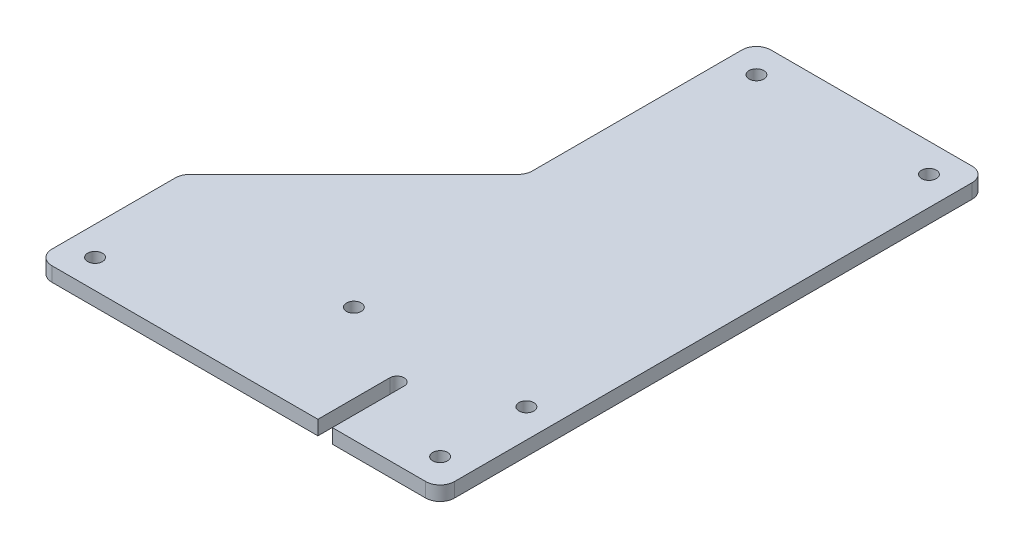
ISO-10303-21;
HEADER;
FILE_DESCRIPTION(('STEP AP214'),'2;1');
FILE_NAME('part.step','',(''),(''),'','','');
FILE_SCHEMA(('AUTOMOTIVE_DESIGN { 1 0 10303 214 1 1 1 1 }'));
ENDSEC;
DATA;
#1=APPLICATION_CONTEXT('core data for automotive mechanical design processes');
#2=APPLICATION_PROTOCOL_DEFINITION('international standard','automotive_design',2000,#1);
#3=PRODUCT_CONTEXT('',#1,'mechanical');
#4=PRODUCT('Part','Part','',(#3));
#5=PRODUCT_RELATED_PRODUCT_CATEGORY('part','',(#4));
#6=PRODUCT_DEFINITION_FORMATION('','',#4);
#7=PRODUCT_DEFINITION_CONTEXT('part definition',#1,'design');
#8=PRODUCT_DEFINITION('design','',#6,#7);
#9=PRODUCT_DEFINITION_SHAPE('','',#8);
#10=(LENGTH_UNIT() NAMED_UNIT(*) SI_UNIT(.MILLI.,.METRE.));
#11=(NAMED_UNIT(*) PLANE_ANGLE_UNIT() SI_UNIT($,.RADIAN.));
#12=(NAMED_UNIT(*) SI_UNIT($,.STERADIAN.) SOLID_ANGLE_UNIT());
#13=UNCERTAINTY_MEASURE_WITH_UNIT(LENGTH_MEASURE(1.E-05),#10,'distance_accuracy_value','');
#14=(GEOMETRIC_REPRESENTATION_CONTEXT(3) GLOBAL_UNCERTAINTY_ASSIGNED_CONTEXT((#13)) GLOBAL_UNIT_ASSIGNED_CONTEXT((#10,
#11,#12)) REPRESENTATION_CONTEXT('',''));
#15=CARTESIAN_POINT('',(0.,0.,0.));
#16=DIRECTION('',(0.,0.,1.));
#17=DIRECTION('',(1.,0.,0.));
#18=AXIS2_PLACEMENT_3D('',#15,#16,#17);
#19=CARTESIAN_POINT('',(88.9,6.35,12.7));
#20=DIRECTION('',(0.,0.,-1.));
#21=DIRECTION('',(-1.,0.,0.));
#22=AXIS2_PLACEMENT_3D('',#19,#20,#21);
#23=PLANE('',#22);
#24=DIRECTION('',(1.,0.,0.));
#25=VECTOR('',#24,1.);
#26=CARTESIAN_POINT('',(88.9,6.35,12.7));
#27=LINE('',#26,#25);
#28=CARTESIAN_POINT('',(41.275,6.35,12.7));
#29=VERTEX_POINT('',#28);
#30=CARTESIAN_POINT('',(82.55,6.35,12.7));
#31=VERTEX_POINT('',#30);
#32=EDGE_CURVE('E172',#29,#31,#27,.T.);
#33=ORIENTED_EDGE('',*,*,#32,.F.);
#34=DIRECTION('',(0.,1.,0.));
#35=VECTOR('',#34,1.);
#36=CARTESIAN_POINT('',(41.275,-0.00100000000000013,12.7));
#37=LINE('',#36,#35);
#38=CARTESIAN_POINT('',(41.275,0.,12.7));
#39=VERTEX_POINT('',#38);
#40=EDGE_CURVE('E165',#39,#29,#37,.T.);
#41=ORIENTED_EDGE('',*,*,#40,.F.);
#42=DIRECTION('',(1.,0.,0.));
#43=VECTOR('',#42,1.);
#44=CARTESIAN_POINT('',(88.9,0.,12.7));
#45=LINE('',#44,#43);
#46=CARTESIAN_POINT('',(82.55,0.,12.7));
#47=VERTEX_POINT('',#46);
#48=EDGE_CURVE('E193',#39,#47,#45,.T.);
#49=ORIENTED_EDGE('',*,*,#48,.T.);
#50=DIRECTION('',(0.,-1.,0.));
#51=VECTOR('',#50,1.);
#52=CARTESIAN_POINT('',(82.55,6.35,12.7));
#53=LINE('',#52,#51);
#54=EDGE_CURVE('E236',#47,#31,#53,.F.);
#55=ORIENTED_EDGE('',*,*,#54,.T.);
#56=EDGE_LOOP('',(#33,#41,#49,#55));
#57=FACE_BOUND('',#56,.T.);
#58=ADVANCED_FACE('F33',(#57),#23,.F.);
#59=CARTESIAN_POINT('',(-12.7,6.35,-127.));
#60=DIRECTION('',(1.,0.,0.));
#61=DIRECTION('',(0.,0.,-1.));
#62=AXIS2_PLACEMENT_3D('',#59,#60,#61);
#63=PLANE('',#62);
#64=DIRECTION('',(0.,0.,1.));
#65=VECTOR('',#64,1.);
#66=CARTESIAN_POINT('',(-12.7,6.35,-127.));
#67=LINE('',#66,#65);
#68=CARTESIAN_POINT('',(-12.7,6.35,-222.25));
#69=VERTEX_POINT('',#68);
#70=CARTESIAN_POINT('',(-12.7,6.35,-129.630256121069));
#71=VERTEX_POINT('',#70);
#72=EDGE_CURVE('E200',#69,#71,#67,.T.);
#73=ORIENTED_EDGE('',*,*,#72,.F.);
#74=DIRECTION('',(0.,-1.,0.));
#75=VECTOR('',#74,1.);
#76=CARTESIAN_POINT('',(-12.7,6.35,-222.25));
#77=LINE('',#76,#75);
#78=CARTESIAN_POINT('',(-12.7,0.,-222.25));
#79=VERTEX_POINT('',#78);
#80=EDGE_CURVE('E202',#69,#79,#77,.T.);
#81=ORIENTED_EDGE('',*,*,#80,.T.);
#82=DIRECTION('',(0.,0.,1.));
#83=VECTOR('',#82,1.);
#84=CARTESIAN_POINT('',(-12.7,0.,-127.));
#85=LINE('',#84,#83);
#86=CARTESIAN_POINT('',(-12.7,0.,-129.630256121069));
#87=VERTEX_POINT('',#86);
#88=EDGE_CURVE('E183',#79,#87,#85,.T.);
#89=ORIENTED_EDGE('',*,*,#88,.T.);
#90=DIRECTION('',(0.,-1.,0.));
#91=VECTOR('',#90,1.);
#92=CARTESIAN_POINT('',(-12.7,6.35,-129.630256121069));
#93=LINE('',#92,#91);
#94=EDGE_CURVE('E182',#87,#71,#93,.F.);
#95=ORIENTED_EDGE('',*,*,#94,.T.);
#96=EDGE_LOOP('',(#73,#81,#89,#95));
#97=FACE_BOUND('',#96,.T.);
#98=ADVANCED_FACE('F259',(#97),#63,.F.);
#99=CARTESIAN_POINT('',(-88.9,6.35,-50.8));
#100=DIRECTION('',(0.707106781186549,0.,0.707106781186546));
#101=DIRECTION('',(0.707106781186546,0.,-0.707106781186549));
#102=AXIS2_PLACEMENT_3D('',#99,#100,#101);
#103=PLANE('',#102);
#104=DIRECTION('',(-0.707106781186546,0.,0.707106781186549));
#105=VECTOR('',#104,1.);
#106=CARTESIAN_POINT('',(-88.9,0.,-50.8));
#107=LINE('',#106,#105);
#108=CARTESIAN_POINT('',(-14.5598719394654,0.,-125.140128060535));
#109=VERTEX_POINT('',#108);
#110=CARTESIAN_POINT('',(-87.0401280605346,0.,-52.6598719394654));
#111=VERTEX_POINT('',#110);
#112=EDGE_CURVE('E186',#109,#111,#107,.T.);
#113=ORIENTED_EDGE('',*,*,#112,.T.);
#114=DIRECTION('',(0.,-1.,0.));
#115=VECTOR('',#114,1.);
#116=CARTESIAN_POINT('',(-87.0401280605346,6.35,-52.6598719394654));
#117=LINE('',#116,#115);
#118=CARTESIAN_POINT('',(-87.0401280605346,6.35,-52.6598719394654));
#119=VERTEX_POINT('',#118);
#120=EDGE_CURVE('E247',#111,#119,#117,.F.);
#121=ORIENTED_EDGE('',*,*,#120,.T.);
#122=DIRECTION('',(-0.707106781186546,0.,0.707106781186549));
#123=VECTOR('',#122,1.);
#124=CARTESIAN_POINT('',(-88.9,6.35,-50.8));
#125=LINE('',#124,#123);
#126=CARTESIAN_POINT('',(-14.5598719394654,6.35,-125.140128060535));
#127=VERTEX_POINT('',#126);
#128=EDGE_CURVE('E265',#127,#119,#125,.T.);
#129=ORIENTED_EDGE('',*,*,#128,.F.);
#130=DIRECTION('',(0.,-1.,0.));
#131=VECTOR('',#130,1.);
#132=CARTESIAN_POINT('',(-14.5598719394654,0.,-125.140128060535));
#133=LINE('',#132,#131);
#134=EDGE_CURVE('E244',#127,#109,#133,.T.);
#135=ORIENTED_EDGE('',*,*,#134,.T.);
#136=EDGE_LOOP('',(#113,#121,#129,#135));
#137=FACE_BOUND('',#136,.T.);
#138=ADVANCED_FACE('F268',(#137),#103,.F.);
#139=CARTESIAN_POINT('',(-88.9,6.35,12.7));
#140=DIRECTION('',(1.,0.,0.));
#141=DIRECTION('',(0.,0.,-1.));
#142=AXIS2_PLACEMENT_3D('',#139,#140,#141);
#143=PLANE('',#142);
#144=DIRECTION('',(0.,0.,1.));
#145=VECTOR('',#144,1.);
#146=CARTESIAN_POINT('',(-88.9,0.,12.7));
#147=LINE('',#146,#145);
#148=CARTESIAN_POINT('',(-88.9,0.,-48.1697438789308));
#149=VERTEX_POINT('',#148);
#150=CARTESIAN_POINT('',(-88.9,0.,6.35000000000002));
#151=VERTEX_POINT('',#150);
#152=EDGE_CURVE('E190',#149,#151,#147,.T.);
#153=ORIENTED_EDGE('',*,*,#152,.T.);
#154=DIRECTION('',(0.,-1.,0.));
#155=VECTOR('',#154,1.);
#156=CARTESIAN_POINT('',(-88.9,6.35,6.35000000000002));
#157=LINE('',#156,#155);
#158=CARTESIAN_POINT('',(-88.9,6.35,6.35000000000002));
#159=VERTEX_POINT('',#158);
#160=EDGE_CURVE('E242',#151,#159,#157,.F.);
#161=ORIENTED_EDGE('',*,*,#160,.T.);
#162=DIRECTION('',(0.,0.,1.));
#163=VECTOR('',#162,1.);
#164=CARTESIAN_POINT('',(-88.9,6.35,12.7));
#165=LINE('',#164,#163);
#166=CARTESIAN_POINT('',(-88.9,6.35,-48.1697438789308));
#167=VERTEX_POINT('',#166);
#168=EDGE_CURVE('E176',#167,#159,#165,.T.);
#169=ORIENTED_EDGE('',*,*,#168,.F.);
#170=DIRECTION('',(0.,-1.,0.));
#171=VECTOR('',#170,1.);
#172=CARTESIAN_POINT('',(-88.9,6.35,-48.1697438789308));
#173=LINE('',#172,#171);
#174=EDGE_CURVE('E239',#167,#149,#173,.T.);
#175=ORIENTED_EDGE('',*,*,#174,.T.);
#176=EDGE_LOOP('',(#153,#161,#169,#175));
#177=FACE_BOUND('',#176,.T.);
#178=ADVANCED_FACE('F367',(#177),#143,.F.);
#179=CARTESIAN_POINT('',(-82.55,0.,12.7));
#180=VERTEX_POINT('',#179);
#181=CARTESIAN_POINT('',(34.925,0.,12.7));
#182=VERTEX_POINT('',#181);
#183=EDGE_CURVE('E164',#180,#182,#45,.T.);
#184=ORIENTED_EDGE('',*,*,#183,.T.);
#185=DIRECTION('',(0.,-1.,0.));
#186=VECTOR('',#185,1.);
#187=CARTESIAN_POINT('',(34.925,-0.00100000000000013,12.7));
#188=LINE('',#187,#186);
#189=CARTESIAN_POINT('',(34.925,6.35,12.7));
#190=VERTEX_POINT('',#189);
#191=EDGE_CURVE('E48',#190,#182,#188,.T.);
#192=ORIENTED_EDGE('',*,*,#191,.F.);
#193=CARTESIAN_POINT('',(-82.55,6.35,12.7));
#194=VERTEX_POINT('',#193);
#195=EDGE_CURVE('E161',#194,#190,#27,.T.);
#196=ORIENTED_EDGE('',*,*,#195,.F.);
#197=DIRECTION('',(0.,-1.,0.));
#198=VECTOR('',#197,1.);
#199=CARTESIAN_POINT('',(-82.55,6.35,12.7));
#200=LINE('',#199,#198);
#201=EDGE_CURVE('E234',#194,#180,#200,.T.);
#202=ORIENTED_EDGE('',*,*,#201,.T.);
#203=EDGE_LOOP('',(#184,#192,#196,#202));
#204=FACE_BOUND('',#203,.T.);
#205=ADVANCED_FACE('F159',(#204),#23,.F.);
#206=CARTESIAN_POINT('',(88.9,6.35,-228.6));
#207=DIRECTION('',(-1.,0.,0.));
#208=DIRECTION('',(0.,0.,1.));
#209=AXIS2_PLACEMENT_3D('',#206,#207,#208);
#210=PLANE('',#209);
#211=DIRECTION('',(0.,0.,-1.));
#212=VECTOR('',#211,1.);
#213=CARTESIAN_POINT('',(88.9,0.,-228.6));
#214=LINE('',#213,#212);
#215=CARTESIAN_POINT('',(88.9,0.,6.34999999999999));
#216=VERTEX_POINT('',#215);
#217=CARTESIAN_POINT('',(88.9,0.,-222.25));
#218=VERTEX_POINT('',#217);
#219=EDGE_CURVE('E195',#216,#218,#214,.T.);
#220=ORIENTED_EDGE('',*,*,#219,.T.);
#221=DIRECTION('',(0.,-1.,0.));
#222=VECTOR('',#221,1.);
#223=CARTESIAN_POINT('',(88.9,6.35,-222.25));
#224=LINE('',#223,#222);
#225=CARTESIAN_POINT('',(88.9,6.35,-222.25));
#226=VERTEX_POINT('',#225);
#227=EDGE_CURVE('E56',#218,#226,#224,.F.);
#228=ORIENTED_EDGE('',*,*,#227,.T.);
#229=DIRECTION('',(0.,0.,-1.));
#230=VECTOR('',#229,1.);
#231=CARTESIAN_POINT('',(88.9,6.35,-228.6));
#232=LINE('',#231,#230);
#233=CARTESIAN_POINT('',(88.9,6.35,6.34999999999999));
#234=VERTEX_POINT('',#233);
#235=EDGE_CURVE('E171',#234,#226,#232,.T.);
#236=ORIENTED_EDGE('',*,*,#235,.F.);
#237=DIRECTION('',(0.,-1.,0.));
#238=VECTOR('',#237,1.);
#239=CARTESIAN_POINT('',(88.9,6.35,6.34999999999999));
#240=LINE('',#239,#238);
#241=EDGE_CURVE('E230',#234,#216,#240,.T.);
#242=ORIENTED_EDGE('',*,*,#241,.T.);
#243=EDGE_LOOP('',(#220,#228,#236,#242));
#244=FACE_BOUND('',#243,.T.);
#245=ADVANCED_FACE('F333',(#244),#210,.F.);
#246=CARTESIAN_POINT('',(-12.7,6.35,-228.6));
#247=DIRECTION('',(0.,0.,1.));
#248=DIRECTION('',(1.,0.,0.));
#249=AXIS2_PLACEMENT_3D('',#246,#247,#248);
#250=PLANE('',#249);
#251=DIRECTION('',(-1.,0.,0.));
#252=VECTOR('',#251,1.);
#253=CARTESIAN_POINT('',(-12.7,0.,-228.6));
#254=LINE('',#253,#252);
#255=CARTESIAN_POINT('',(82.55,0.,-228.6));
#256=VERTEX_POINT('',#255);
#257=CARTESIAN_POINT('',(-6.35,0.,-228.6));
#258=VERTEX_POINT('',#257);
#259=EDGE_CURVE('E197',#256,#258,#254,.T.);
#260=ORIENTED_EDGE('',*,*,#259,.T.);
#261=DIRECTION('',(0.,-1.,0.));
#262=VECTOR('',#261,1.);
#263=CARTESIAN_POINT('',(-6.35,6.35,-228.6));
#264=LINE('',#263,#262);
#265=CARTESIAN_POINT('',(-6.35,6.35,-228.6));
#266=VERTEX_POINT('',#265);
#267=EDGE_CURVE('E219',#258,#266,#264,.F.);
#268=ORIENTED_EDGE('',*,*,#267,.T.);
#269=DIRECTION('',(-1.,0.,0.));
#270=VECTOR('',#269,1.);
#271=CARTESIAN_POINT('',(-12.7,6.35,-228.6));
#272=LINE('',#271,#270);
#273=CARTESIAN_POINT('',(82.55,6.35,-228.6));
#274=VERTEX_POINT('',#273);
#275=EDGE_CURVE('E174',#274,#266,#272,.T.);
#276=ORIENTED_EDGE('',*,*,#275,.F.);
#277=DIRECTION('',(0.,-1.,0.));
#278=VECTOR('',#277,1.);
#279=CARTESIAN_POINT('',(82.55,6.35,-228.6));
#280=LINE('',#279,#278);
#281=EDGE_CURVE('E216',#274,#256,#280,.T.);
#282=ORIENTED_EDGE('',*,*,#281,.T.);
#283=EDGE_LOOP('',(#260,#268,#276,#282));
#284=FACE_BOUND('',#283,.T.);
#285=ADVANCED_FACE('F341',(#284),#250,.F.);
#286=CARTESIAN_POINT('',(0.,6.35,0.));
#287=DIRECTION('',(0.,-1.,0.));
#288=DIRECTION('',(0.,0.,-1.));
#289=AXIS2_PLACEMENT_3D('',#286,#287,#288);
#290=PLANE('',#289);
#291=CARTESIAN_POINT('',(76.2,6.35,-215.9));
#292=DIRECTION('',(0.,1.,0.));
#293=DIRECTION('',(0.,0.,1.));
#294=AXIS2_PLACEMENT_3D('',#291,#292,#293);
#295=CIRCLE('',#294,3.26389999999999);
#296=CARTESIAN_POINT('',(76.2,6.35,-212.6361));
#297=VERTEX_POINT('',#296);
#298=EDGE_CURVE('E304',#297,#297,#295,.T.);
#299=ORIENTED_EDGE('',*,*,#298,.F.);
#300=EDGE_LOOP('',(#299));
#301=FACE_BOUND('',#300,.T.);
#302=CARTESIAN_POINT('',(0.,6.35,-215.9));
#303=DIRECTION('',(0.,1.,0.));
#304=DIRECTION('',(0.,0.,1.));
#305=AXIS2_PLACEMENT_3D('',#302,#303,#304);
#306=CIRCLE('',#305,3.26389999999999);
#307=CARTESIAN_POINT('',(0.,6.35,-212.6361));
#308=VERTEX_POINT('',#307);
#309=EDGE_CURVE('E298',#308,#308,#306,.T.);
#310=ORIENTED_EDGE('',*,*,#309,.F.);
#311=EDGE_LOOP('',(#310));
#312=FACE_BOUND('',#311,.T.);
#313=CARTESIAN_POINT('',(0.,6.35,-38.1));
#314=DIRECTION('',(0.,1.,0.));
#315=DIRECTION('',(0.,0.,1.));
#316=AXIS2_PLACEMENT_3D('',#313,#314,#315);
#317=CIRCLE('',#316,3.26389999999999);
#318=CARTESIAN_POINT('',(0.,6.35,-34.8361));
#319=VERTEX_POINT('',#318);
#320=EDGE_CURVE('E292',#319,#319,#317,.T.);
#321=ORIENTED_EDGE('',*,*,#320,.F.);
#322=EDGE_LOOP('',(#321));
#323=FACE_BOUND('',#322,.T.);
#324=CARTESIAN_POINT('',(76.2,6.35,-38.1));
#325=DIRECTION('',(0.,1.,0.));
#326=DIRECTION('',(0.,0.,1.));
#327=AXIS2_PLACEMENT_3D('',#324,#325,#326);
#328=CIRCLE('',#327,3.26389999999999);
#329=CARTESIAN_POINT('',(76.2,6.35,-34.8361));
#330=VERTEX_POINT('',#329);
#331=EDGE_CURVE('E286',#330,#330,#328,.T.);
#332=ORIENTED_EDGE('',*,*,#331,.F.);
#333=EDGE_LOOP('',(#332));
#334=FACE_BOUND('',#333,.T.);
#335=CARTESIAN_POINT('',(76.2,6.35,0.));
#336=DIRECTION('',(0.,1.,0.));
#337=DIRECTION('',(0.,0.,1.));
#338=AXIS2_PLACEMENT_3D('',#335,#336,#337);
#339=CIRCLE('',#338,3.26389999999999);
#340=CARTESIAN_POINT('',(76.2,6.35,3.26389999999999));
#341=VERTEX_POINT('',#340);
#342=EDGE_CURVE('E280',#341,#341,#339,.T.);
#343=ORIENTED_EDGE('',*,*,#342,.F.);
#344=EDGE_LOOP('',(#343));
#345=FACE_BOUND('',#344,.T.);
#346=CARTESIAN_POINT('',(-76.2,6.35,0.));
#347=DIRECTION('',(0.,1.,0.));
#348=DIRECTION('',(0.,0.,1.));
#349=AXIS2_PLACEMENT_3D('',#346,#347,#348);
#350=CIRCLE('',#349,3.26389999999999);
#351=CARTESIAN_POINT('',(-76.2,6.35,3.26389999999999));
#352=VERTEX_POINT('',#351);
#353=EDGE_CURVE('E274',#352,#352,#350,.T.);
#354=ORIENTED_EDGE('',*,*,#353,.F.);
#355=EDGE_LOOP('',(#354));
#356=FACE_BOUND('',#355,.T.);
#357=CARTESIAN_POINT('',(38.1,6.35,-19.05));
#358=DIRECTION('',(0.,1.,0.));
#359=DIRECTION('',(0.,0.,1.));
#360=AXIS2_PLACEMENT_3D('',#357,#358,#359);
#361=CIRCLE('',#360,3.175);
#362=CARTESIAN_POINT('',(41.275,6.35,-19.05));
#363=VERTEX_POINT('',#362);
#364=CARTESIAN_POINT('',(34.925,6.35,-19.05));
#365=VERTEX_POINT('',#364);
#366=EDGE_CURVE('E154',#363,#365,#361,.T.);
#367=ORIENTED_EDGE('',*,*,#366,.F.);
#368=DIRECTION('',(0.,0.,-1.));
#369=VECTOR('',#368,1.);
#370=CARTESIAN_POINT('',(41.275,6.35,-19.05));
#371=LINE('',#370,#369);
#372=EDGE_CURVE('E153',#29,#363,#371,.T.);
#373=ORIENTED_EDGE('',*,*,#372,.F.);
#374=ORIENTED_EDGE('',*,*,#32,.T.);
#375=CARTESIAN_POINT('',(82.55,6.35,6.34999999999999));
#376=DIRECTION('',(0.,-1.,0.));
#377=DIRECTION('',(0.,0.,-1.));
#378=AXIS2_PLACEMENT_3D('',#375,#376,#377);
#379=CIRCLE('',#378,6.35);
#380=EDGE_CURVE('E224',#31,#234,#379,.F.);
#381=ORIENTED_EDGE('',*,*,#380,.T.);
#382=ORIENTED_EDGE('',*,*,#235,.T.);
#383=CARTESIAN_POINT('',(82.55,6.35,-222.25));
#384=DIRECTION('',(0.,-1.,0.));
#385=DIRECTION('',(0.,0.,-1.));
#386=AXIS2_PLACEMENT_3D('',#383,#384,#385);
#387=CIRCLE('',#386,6.35);
#388=EDGE_CURVE('E226',#226,#274,#387,.F.);
#389=ORIENTED_EDGE('',*,*,#388,.T.);
#390=ORIENTED_EDGE('',*,*,#275,.T.);
#391=CARTESIAN_POINT('',(-6.35,6.35,-222.25));
#392=DIRECTION('',(0.,-1.,0.));
#393=DIRECTION('',(0.,0.,-1.));
#394=AXIS2_PLACEMENT_3D('',#391,#392,#393);
#395=CIRCLE('',#394,6.35);
#396=EDGE_CURVE('E228',#266,#69,#395,.F.);
#397=ORIENTED_EDGE('',*,*,#396,.T.);
#398=ORIENTED_EDGE('',*,*,#72,.T.);
#399=CARTESIAN_POINT('',(-19.05,6.35,-129.630256121069));
#400=DIRECTION('',(0.,-1.,0.));
#401=DIRECTION('',(0.,0.,-1.));
#402=AXIS2_PLACEMENT_3D('',#399,#400,#401);
#403=CIRCLE('',#402,6.35);
#404=EDGE_CURVE('E11',#71,#127,#403,.T.);
#405=ORIENTED_EDGE('',*,*,#404,.T.);
#406=ORIENTED_EDGE('',*,*,#128,.T.);
#407=CARTESIAN_POINT('',(-82.55,6.35,-48.1697438789308));
#408=DIRECTION('',(0.,-1.,0.));
#409=DIRECTION('',(0.,0.,-1.));
#410=AXIS2_PLACEMENT_3D('',#407,#408,#409);
#411=CIRCLE('',#410,6.35);
#412=EDGE_CURVE('E221',#119,#167,#411,.F.);
#413=ORIENTED_EDGE('',*,*,#412,.T.);
#414=ORIENTED_EDGE('',*,*,#168,.T.);
#415=CARTESIAN_POINT('',(-82.55,6.35,6.35000000000002));
#416=DIRECTION('',(0.,-1.,0.));
#417=DIRECTION('',(0.,0.,-1.));
#418=AXIS2_PLACEMENT_3D('',#415,#416,#417);
#419=CIRCLE('',#418,6.35);
#420=EDGE_CURVE('E170',#159,#194,#419,.F.);
#421=ORIENTED_EDGE('',*,*,#420,.T.);
#422=ORIENTED_EDGE('',*,*,#195,.T.);
#423=DIRECTION('',(0.,0.,1.));
#424=VECTOR('',#423,1.);
#425=CARTESIAN_POINT('',(34.925,6.35,-19.05));
#426=LINE('',#425,#424);
#427=EDGE_CURVE('E146',#365,#190,#426,.T.);
#428=ORIENTED_EDGE('',*,*,#427,.F.);
#429=EDGE_LOOP('',(#367,#373,#374,#381,#382,#389,#390,#397,#398,#405,#406,#413,#414,#421,#422,#428));
#430=FACE_BOUND('',#429,.T.);
#431=ADVANCED_FACE('F167',(#301,#312,#323,#334,#345,#356,#430),#290,.F.);
#432=CARTESIAN_POINT('',(0.,0.,0.));
#433=DIRECTION('',(0.,-1.,0.));
#434=DIRECTION('',(0.,0.,-1.));
#435=AXIS2_PLACEMENT_3D('',#432,#433,#434);
#436=PLANE('',#435);
#437=DIRECTION('',(0.,0.,-1.));
#438=VECTOR('',#437,1.);
#439=CARTESIAN_POINT('',(41.275,0.,-19.05));
#440=LINE('',#439,#438);
#441=CARTESIAN_POINT('',(41.275,0.,-19.05));
#442=VERTEX_POINT('',#441);
#443=EDGE_CURVE('E315',#39,#442,#440,.T.);
#444=ORIENTED_EDGE('',*,*,#443,.T.);
#445=CARTESIAN_POINT('',(38.1,0.,-19.05));
#446=DIRECTION('',(0.,-1.,0.));
#447=DIRECTION('',(0.,0.,-1.));
#448=AXIS2_PLACEMENT_3D('',#445,#446,#447);
#449=CIRCLE('',#448,3.175);
#450=CARTESIAN_POINT('',(34.925,0.,-19.05));
#451=VERTEX_POINT('',#450);
#452=EDGE_CURVE('E317',#442,#451,#449,.F.);
#453=ORIENTED_EDGE('',*,*,#452,.T.);
#454=DIRECTION('',(0.,0.,1.));
#455=VECTOR('',#454,1.);
#456=CARTESIAN_POINT('',(34.925,0.,-19.05));
#457=LINE('',#456,#455);
#458=EDGE_CURVE('E307',#451,#182,#457,.T.);
#459=ORIENTED_EDGE('',*,*,#458,.T.);
#460=ORIENTED_EDGE('',*,*,#183,.F.);
#461=CARTESIAN_POINT('',(-82.55,0.,6.35000000000002));
#462=DIRECTION('',(0.,-1.,0.));
#463=DIRECTION('',(0.,0.,-1.));
#464=AXIS2_PLACEMENT_3D('',#461,#462,#463);
#465=CIRCLE('',#464,6.35);
#466=EDGE_CURVE('E207',#180,#151,#465,.T.);
#467=ORIENTED_EDGE('',*,*,#466,.T.);
#468=ORIENTED_EDGE('',*,*,#152,.F.);
#469=CARTESIAN_POINT('',(-82.55,0.,-48.1697438789308));
#470=DIRECTION('',(0.,-1.,0.));
#471=DIRECTION('',(0.,0.,-1.));
#472=AXIS2_PLACEMENT_3D('',#469,#470,#471);
#473=CIRCLE('',#472,6.35);
#474=EDGE_CURVE('E205',#149,#111,#473,.T.);
#475=ORIENTED_EDGE('',*,*,#474,.T.);
#476=ORIENTED_EDGE('',*,*,#112,.F.);
#477=CARTESIAN_POINT('',(-19.05,0.,-129.630256121069));
#478=DIRECTION('',(0.,-1.,0.));
#479=DIRECTION('',(0.,0.,-1.));
#480=AXIS2_PLACEMENT_3D('',#477,#478,#479);
#481=CIRCLE('',#480,6.35);
#482=EDGE_CURVE('E41',#109,#87,#481,.F.);
#483=ORIENTED_EDGE('',*,*,#482,.T.);
#484=ORIENTED_EDGE('',*,*,#88,.F.);
#485=CARTESIAN_POINT('',(-6.35,0.,-222.25));
#486=DIRECTION('',(0.,-1.,0.));
#487=DIRECTION('',(0.,0.,-1.));
#488=AXIS2_PLACEMENT_3D('',#485,#486,#487);
#489=CIRCLE('',#488,6.35);
#490=EDGE_CURVE('E214',#79,#258,#489,.T.);
#491=ORIENTED_EDGE('',*,*,#490,.T.);
#492=ORIENTED_EDGE('',*,*,#259,.F.);
#493=CARTESIAN_POINT('',(82.55,0.,-222.25));
#494=DIRECTION('',(0.,-1.,0.));
#495=DIRECTION('',(0.,0.,-1.));
#496=AXIS2_PLACEMENT_3D('',#493,#494,#495);
#497=CIRCLE('',#496,6.35);
#498=EDGE_CURVE('E212',#256,#218,#497,.T.);
#499=ORIENTED_EDGE('',*,*,#498,.T.);
#500=ORIENTED_EDGE('',*,*,#219,.F.);
#501=CARTESIAN_POINT('',(82.55,0.,6.34999999999999));
#502=DIRECTION('',(0.,-1.,0.));
#503=DIRECTION('',(0.,0.,-1.));
#504=AXIS2_PLACEMENT_3D('',#501,#502,#503);
#505=CIRCLE('',#504,6.35);
#506=EDGE_CURVE('E209',#216,#47,#505,.T.);
#507=ORIENTED_EDGE('',*,*,#506,.T.);
#508=ORIENTED_EDGE('',*,*,#48,.F.);
#509=EDGE_LOOP('',(#444,#453,#459,#460,#467,#468,#475,#476,#483,#484,#491,#492,#499,#500,#507,#508));
#510=FACE_BOUND('',#509,.T.);
#511=CARTESIAN_POINT('',(76.2,0.,-215.9));
#512=DIRECTION('',(0.,1.,0.));
#513=DIRECTION('',(0.,0.,1.));
#514=AXIS2_PLACEMENT_3D('',#511,#512,#513);
#515=CIRCLE('',#514,3.26389999999999);
#516=CARTESIAN_POINT('',(76.2,0.,-212.6361));
#517=VERTEX_POINT('',#516);
#518=EDGE_CURVE('E301',#517,#517,#515,.T.);
#519=ORIENTED_EDGE('',*,*,#518,.T.);
#520=EDGE_LOOP('',(#519));
#521=FACE_BOUND('',#520,.T.);
#522=CARTESIAN_POINT('',(0.,0.,-215.9));
#523=DIRECTION('',(0.,1.,0.));
#524=DIRECTION('',(0.,0.,1.));
#525=AXIS2_PLACEMENT_3D('',#522,#523,#524);
#526=CIRCLE('',#525,3.26389999999999);
#527=CARTESIAN_POINT('',(0.,0.,-212.6361));
#528=VERTEX_POINT('',#527);
#529=EDGE_CURVE('E295',#528,#528,#526,.T.);
#530=ORIENTED_EDGE('',*,*,#529,.T.);
#531=EDGE_LOOP('',(#530));
#532=FACE_BOUND('',#531,.T.);
#533=CARTESIAN_POINT('',(0.,0.,-38.1));
#534=DIRECTION('',(0.,1.,0.));
#535=DIRECTION('',(0.,0.,1.));
#536=AXIS2_PLACEMENT_3D('',#533,#534,#535);
#537=CIRCLE('',#536,3.26389999999999);
#538=CARTESIAN_POINT('',(0.,0.,-34.8361));
#539=VERTEX_POINT('',#538);
#540=EDGE_CURVE('E289',#539,#539,#537,.T.);
#541=ORIENTED_EDGE('',*,*,#540,.T.);
#542=EDGE_LOOP('',(#541));
#543=FACE_BOUND('',#542,.T.);
#544=CARTESIAN_POINT('',(76.2,0.,-38.1));
#545=DIRECTION('',(0.,1.,0.));
#546=DIRECTION('',(0.,0.,1.));
#547=AXIS2_PLACEMENT_3D('',#544,#545,#546);
#548=CIRCLE('',#547,3.26389999999999);
#549=CARTESIAN_POINT('',(76.2,0.,-34.8361));
#550=VERTEX_POINT('',#549);
#551=EDGE_CURVE('E283',#550,#550,#548,.T.);
#552=ORIENTED_EDGE('',*,*,#551,.T.);
#553=EDGE_LOOP('',(#552));
#554=FACE_BOUND('',#553,.T.);
#555=CARTESIAN_POINT('',(76.2,0.,0.));
#556=DIRECTION('',(0.,1.,0.));
#557=DIRECTION('',(0.,0.,1.));
#558=AXIS2_PLACEMENT_3D('',#555,#556,#557);
#559=CIRCLE('',#558,3.26389999999999);
#560=CARTESIAN_POINT('',(76.2,0.,3.26389999999999));
#561=VERTEX_POINT('',#560);
#562=EDGE_CURVE('E277',#561,#561,#559,.T.);
#563=ORIENTED_EDGE('',*,*,#562,.T.);
#564=EDGE_LOOP('',(#563));
#565=FACE_BOUND('',#564,.T.);
#566=CARTESIAN_POINT('',(-76.2,0.,0.));
#567=DIRECTION('',(0.,1.,0.));
#568=DIRECTION('',(0.,0.,1.));
#569=AXIS2_PLACEMENT_3D('',#566,#567,#568);
#570=CIRCLE('',#569,3.26389999999999);
#571=CARTESIAN_POINT('',(-76.2,0.,3.26389999999999));
#572=VERTEX_POINT('',#571);
#573=EDGE_CURVE('E187',#572,#572,#570,.T.);
#574=ORIENTED_EDGE('',*,*,#573,.T.);
#575=EDGE_LOOP('',(#574));
#576=FACE_BOUND('',#575,.T.);
#577=ADVANCED_FACE('F252',(#510,#521,#532,#543,#554,#565,#576),#436,.T.);
#578=CARTESIAN_POINT('',(-76.2,6.35,0.));
#579=DIRECTION('',(0.,1.,0.));
#580=DIRECTION('',(0.,0.,1.));
#581=AXIS2_PLACEMENT_3D('',#578,#579,#580);
#582=CYLINDRICAL_SURFACE('',#581,3.26389999999999);
#583=ORIENTED_EDGE('',*,*,#573,.F.);
#584=EDGE_LOOP('',(#583));
#585=FACE_BOUND('',#584,.T.);
#586=ORIENTED_EDGE('',*,*,#353,.T.);
#587=EDGE_LOOP('',(#586));
#588=FACE_BOUND('',#587,.T.);
#589=ADVANCED_FACE('F412',(#585,#588),#582,.F.);
#590=CARTESIAN_POINT('',(76.2,6.35,0.));
#591=DIRECTION('',(0.,1.,0.));
#592=DIRECTION('',(0.,0.,1.));
#593=AXIS2_PLACEMENT_3D('',#590,#591,#592);
#594=CYLINDRICAL_SURFACE('',#593,3.26389999999999);
#595=ORIENTED_EDGE('',*,*,#562,.F.);
#596=EDGE_LOOP('',(#595));
#597=FACE_BOUND('',#596,.T.);
#598=ORIENTED_EDGE('',*,*,#342,.T.);
#599=EDGE_LOOP('',(#598));
#600=FACE_BOUND('',#599,.T.);
#601=ADVANCED_FACE('F408',(#597,#600),#594,.F.);
#602=CARTESIAN_POINT('',(76.2,6.35,-38.1));
#603=DIRECTION('',(0.,1.,0.));
#604=DIRECTION('',(0.,0.,1.));
#605=AXIS2_PLACEMENT_3D('',#602,#603,#604);
#606=CYLINDRICAL_SURFACE('',#605,3.26389999999999);
#607=ORIENTED_EDGE('',*,*,#551,.F.);
#608=EDGE_LOOP('',(#607));
#609=FACE_BOUND('',#608,.T.);
#610=ORIENTED_EDGE('',*,*,#331,.T.);
#611=EDGE_LOOP('',(#610));
#612=FACE_BOUND('',#611,.T.);
#613=ADVANCED_FACE('F404',(#609,#612),#606,.F.);
#614=CARTESIAN_POINT('',(0.,6.35,-38.1));
#615=DIRECTION('',(0.,1.,0.));
#616=DIRECTION('',(0.,0.,1.));
#617=AXIS2_PLACEMENT_3D('',#614,#615,#616);
#618=CYLINDRICAL_SURFACE('',#617,3.26389999999999);
#619=ORIENTED_EDGE('',*,*,#540,.F.);
#620=EDGE_LOOP('',(#619));
#621=FACE_BOUND('',#620,.T.);
#622=ORIENTED_EDGE('',*,*,#320,.T.);
#623=EDGE_LOOP('',(#622));
#624=FACE_BOUND('',#623,.T.);
#625=ADVANCED_FACE('F400',(#621,#624),#618,.F.);
#626=CARTESIAN_POINT('',(0.,6.35,-215.9));
#627=DIRECTION('',(0.,1.,0.));
#628=DIRECTION('',(0.,0.,1.));
#629=AXIS2_PLACEMENT_3D('',#626,#627,#628);
#630=CYLINDRICAL_SURFACE('',#629,3.26389999999999);
#631=ORIENTED_EDGE('',*,*,#529,.F.);
#632=EDGE_LOOP('',(#631));
#633=FACE_BOUND('',#632,.T.);
#634=ORIENTED_EDGE('',*,*,#309,.T.);
#635=EDGE_LOOP('',(#634));
#636=FACE_BOUND('',#635,.T.);
#637=ADVANCED_FACE('F354',(#633,#636),#630,.F.);
#638=CARTESIAN_POINT('',(76.2,6.35,-215.9));
#639=DIRECTION('',(0.,1.,0.));
#640=DIRECTION('',(0.,0.,1.));
#641=AXIS2_PLACEMENT_3D('',#638,#639,#640);
#642=CYLINDRICAL_SURFACE('',#641,3.26389999999999);
#643=ORIENTED_EDGE('',*,*,#518,.F.);
#644=EDGE_LOOP('',(#643));
#645=FACE_BOUND('',#644,.T.);
#646=ORIENTED_EDGE('',*,*,#298,.T.);
#647=EDGE_LOOP('',(#646));
#648=FACE_BOUND('',#647,.T.);
#649=ADVANCED_FACE('F347',(#645,#648),#642,.F.);
#650=CARTESIAN_POINT('',(-6.35,6.35,-222.25));
#651=DIRECTION('',(0.,-1.,0.));
#652=DIRECTION('',(0.,0.,-1.));
#653=AXIS2_PLACEMENT_3D('',#650,#651,#652);
#654=CYLINDRICAL_SURFACE('',#653,6.35);
#655=ORIENTED_EDGE('',*,*,#396,.F.);
#656=ORIENTED_EDGE('',*,*,#267,.F.);
#657=ORIENTED_EDGE('',*,*,#490,.F.);
#658=ORIENTED_EDGE('',*,*,#80,.F.);
#659=EDGE_LOOP('',(#655,#656,#657,#658));
#660=FACE_BOUND('',#659,.T.);
#661=ADVANCED_FACE('F345',(#660),#654,.T.);
#662=CARTESIAN_POINT('',(82.55,6.35,-222.25));
#663=DIRECTION('',(0.,-1.,0.));
#664=DIRECTION('',(0.,0.,-1.));
#665=AXIS2_PLACEMENT_3D('',#662,#663,#664);
#666=CYLINDRICAL_SURFACE('',#665,6.35);
#667=ORIENTED_EDGE('',*,*,#388,.F.);
#668=ORIENTED_EDGE('',*,*,#227,.F.);
#669=ORIENTED_EDGE('',*,*,#498,.F.);
#670=ORIENTED_EDGE('',*,*,#281,.F.);
#671=EDGE_LOOP('',(#667,#668,#669,#670));
#672=FACE_BOUND('',#671,.T.);
#673=ADVANCED_FACE('F338',(#672),#666,.T.);
#674=CARTESIAN_POINT('',(82.55,6.35,6.34999999999999));
#675=DIRECTION('',(0.,-1.,0.));
#676=DIRECTION('',(0.,0.,-1.));
#677=AXIS2_PLACEMENT_3D('',#674,#675,#676);
#678=CYLINDRICAL_SURFACE('',#677,6.35);
#679=ORIENTED_EDGE('',*,*,#380,.F.);
#680=ORIENTED_EDGE('',*,*,#54,.F.);
#681=ORIENTED_EDGE('',*,*,#506,.F.);
#682=ORIENTED_EDGE('',*,*,#241,.F.);
#683=EDGE_LOOP('',(#679,#680,#681,#682));
#684=FACE_BOUND('',#683,.T.);
#685=ADVANCED_FACE('F331',(#684),#678,.T.);
#686=CARTESIAN_POINT('',(-82.55,6.35,6.35000000000002));
#687=DIRECTION('',(0.,-1.,0.));
#688=DIRECTION('',(0.,0.,-1.));
#689=AXIS2_PLACEMENT_3D('',#686,#687,#688);
#690=CYLINDRICAL_SURFACE('',#689,6.35);
#691=ORIENTED_EDGE('',*,*,#420,.F.);
#692=ORIENTED_EDGE('',*,*,#160,.F.);
#693=ORIENTED_EDGE('',*,*,#466,.F.);
#694=ORIENTED_EDGE('',*,*,#201,.F.);
#695=EDGE_LOOP('',(#691,#692,#693,#694));
#696=FACE_BOUND('',#695,.T.);
#697=ADVANCED_FACE('F383',(#696),#690,.T.);
#698=CARTESIAN_POINT('',(-82.55,6.35,-48.1697438789308));
#699=DIRECTION('',(0.,-1.,0.));
#700=DIRECTION('',(0.,0.,-1.));
#701=AXIS2_PLACEMENT_3D('',#698,#699,#700);
#702=CYLINDRICAL_SURFACE('',#701,6.35);
#703=ORIENTED_EDGE('',*,*,#412,.F.);
#704=ORIENTED_EDGE('',*,*,#120,.F.);
#705=ORIENTED_EDGE('',*,*,#474,.F.);
#706=ORIENTED_EDGE('',*,*,#174,.F.);
#707=EDGE_LOOP('',(#703,#704,#705,#706));
#708=FACE_BOUND('',#707,.T.);
#709=ADVANCED_FACE('F395',(#708),#702,.T.);
#710=CARTESIAN_POINT('',(-19.05,6.35,-129.630256121069));
#711=DIRECTION('',(0.,1.,0.));
#712=DIRECTION('',(0.,0.,1.));
#713=AXIS2_PLACEMENT_3D('',#710,#711,#712);
#714=CYLINDRICAL_SURFACE('',#713,6.35);
#715=ORIENTED_EDGE('',*,*,#404,.F.);
#716=ORIENTED_EDGE('',*,*,#94,.F.);
#717=ORIENTED_EDGE('',*,*,#482,.F.);
#718=ORIENTED_EDGE('',*,*,#134,.F.);
#719=EDGE_LOOP('',(#715,#716,#717,#718));
#720=FACE_BOUND('',#719,.T.);
#721=ADVANCED_FACE('F35',(#720),#714,.F.);
#722=CARTESIAN_POINT('',(38.1,-0.00100000000000013,-19.05));
#723=DIRECTION('',(0.,1.,0.));
#724=DIRECTION('',(0.,0.,1.));
#725=AXIS2_PLACEMENT_3D('',#722,#723,#724);
#726=CYLINDRICAL_SURFACE('',#725,3.175);
#727=DIRECTION('',(0.,1.,0.));
#728=VECTOR('',#727,1.);
#729=CARTESIAN_POINT('',(41.275,-0.00100000000000013,-19.05));
#730=LINE('',#729,#728);
#731=EDGE_CURVE('E309',#442,#363,#730,.T.);
#732=ORIENTED_EDGE('',*,*,#731,.T.);
#733=ORIENTED_EDGE('',*,*,#366,.T.);
#734=DIRECTION('',(0.,1.,0.));
#735=VECTOR('',#734,1.);
#736=CARTESIAN_POINT('',(34.925,-0.00100000000000013,-19.05));
#737=LINE('',#736,#735);
#738=EDGE_CURVE('E148',#451,#365,#737,.T.);
#739=ORIENTED_EDGE('',*,*,#738,.F.);
#740=ORIENTED_EDGE('',*,*,#452,.F.);
#741=EDGE_LOOP('',(#732,#733,#739,#740));
#742=FACE_BOUND('',#741,.T.);
#743=ADVANCED_FACE('F386',(#742),#726,.F.);
#744=CARTESIAN_POINT('',(41.275,-0.00100000000000013,-19.05));
#745=DIRECTION('',(1.,0.,0.));
#746=DIRECTION('',(0.,0.,-1.));
#747=AXIS2_PLACEMENT_3D('',#744,#745,#746);
#748=PLANE('',#747);
#749=ORIENTED_EDGE('',*,*,#40,.T.);
#750=ORIENTED_EDGE('',*,*,#372,.T.);
#751=ORIENTED_EDGE('',*,*,#731,.F.);
#752=ORIENTED_EDGE('',*,*,#443,.F.);
#753=EDGE_LOOP('',(#749,#750,#751,#752));
#754=FACE_BOUND('',#753,.T.);
#755=ADVANCED_FACE('F323',(#754),#748,.F.);
#756=CARTESIAN_POINT('',(34.925,-0.00100000000000013,-19.05));
#757=DIRECTION('',(-1.,0.,0.));
#758=DIRECTION('',(0.,0.,1.));
#759=AXIS2_PLACEMENT_3D('',#756,#757,#758);
#760=PLANE('',#759);
#761=ORIENTED_EDGE('',*,*,#738,.T.);
#762=ORIENTED_EDGE('',*,*,#427,.T.);
#763=ORIENTED_EDGE('',*,*,#191,.T.);
#764=ORIENTED_EDGE('',*,*,#458,.F.);
#765=EDGE_LOOP('',(#761,#762,#763,#764));
#766=FACE_BOUND('',#765,.T.);
#767=ADVANCED_FACE('F147',(#766),#760,.F.);
#768=CLOSED_SHELL('',(#58,#98,#138,#178,#205,#245,#285,#431,#577,#589,#601,#613,#625,#637,#649,
#661,#673,#685,#697,#709,#721,#743,#755,#767));
#769=MANIFOLD_SOLID_BREP('B2',#768);
#770=ADVANCED_BREP_SHAPE_REPRESENTATION('',(#18,#769),#14);
#771=SHAPE_DEFINITION_REPRESENTATION(#9,#770);
ENDSEC;
END-ISO-10303-21;
